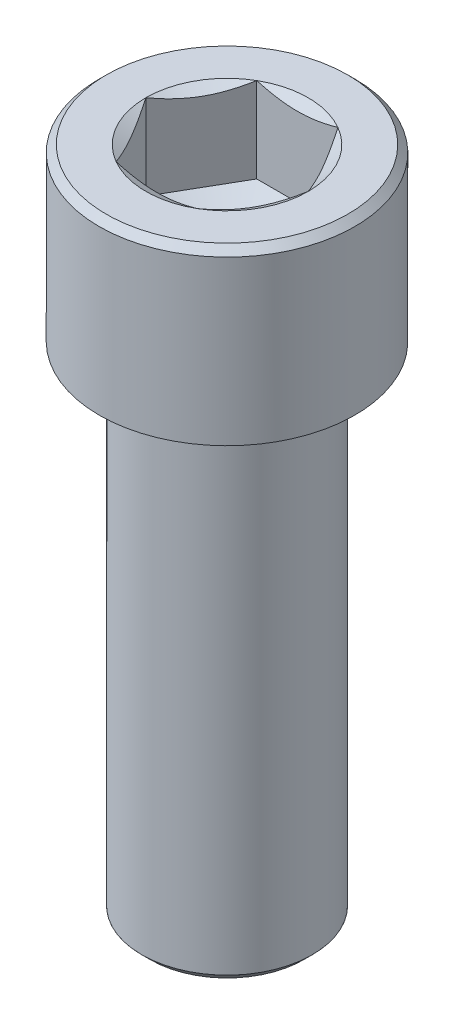
ISO-10303-21;
HEADER;
FILE_DESCRIPTION(('STEP AP214'),'2;1');
FILE_NAME('part.step','',(''),(''),'','','');
FILE_SCHEMA(('AUTOMOTIVE_DESIGN { 1 0 10303 214 1 1 1 1 }'));
ENDSEC;
DATA;
#1=APPLICATION_CONTEXT('core data for automotive mechanical design processes');
#2=APPLICATION_PROTOCOL_DEFINITION('international standard','automotive_design',2000,#1);
#3=PRODUCT_CONTEXT('',#1,'mechanical');
#4=PRODUCT('Part','Part','',(#3));
#5=PRODUCT_RELATED_PRODUCT_CATEGORY('part','',(#4));
#6=PRODUCT_DEFINITION_FORMATION('','',#4);
#7=PRODUCT_DEFINITION_CONTEXT('part definition',#1,'design');
#8=PRODUCT_DEFINITION('design','',#6,#7);
#9=PRODUCT_DEFINITION_SHAPE('','',#8);
#10=(LENGTH_UNIT() NAMED_UNIT(*) SI_UNIT(.MILLI.,.METRE.));
#11=(NAMED_UNIT(*) PLANE_ANGLE_UNIT() SI_UNIT($,.RADIAN.));
#12=(NAMED_UNIT(*) SI_UNIT($,.STERADIAN.) SOLID_ANGLE_UNIT());
#13=UNCERTAINTY_MEASURE_WITH_UNIT(LENGTH_MEASURE(1.E-05),#10,'distance_accuracy_value','');
#14=(GEOMETRIC_REPRESENTATION_CONTEXT(3) GLOBAL_UNCERTAINTY_ASSIGNED_CONTEXT((#13)) GLOBAL_UNIT_ASSIGNED_CONTEXT((#10,
#11,#12)) REPRESENTATION_CONTEXT('',''));
#15=CARTESIAN_POINT('',(0.,0.,0.));
#16=DIRECTION('',(0.,0.,1.));
#17=DIRECTION('',(1.,0.,0.));
#18=AXIS2_PLACEMENT_3D('',#15,#16,#17);
#19=CARTESIAN_POINT('',(0.,-6.00000000002865,0.));
#20=DIRECTION('',(0.,1.,0.));
#21=DIRECTION('',(0.,0.,1.));
#22=AXIS2_PLACEMENT_3D('',#19,#20,#21);
#23=CONICAL_SURFACE('',#22,5.71499999983871,1.04719755114345);
#24=CARTESIAN_POINT('',(2.55795384873636E-10,-9.2995567884202,0.));
#25=VERTEX_POINT('',#24);
#26=VERTEX_LOOP('',#25);
#27=FACE_BOUND('',#26,.T.);
#28=CARTESIAN_POINT('',(0.,-5.99999999996301,0.));
#29=DIRECTION('',(0.,1.,0.));
#30=DIRECTION('',(0.,0.,1.));
#31=AXIS2_PLACEMENT_3D('',#28,#29,#30);
#32=CIRCLE('',#31,5.7149999999524);
#33=CARTESIAN_POINT('',(-2.85749999997536,-5.99999999996301,-4.94933518258732));
#34=VERTEX_POINT('',#33);
#35=CARTESIAN_POINT('',(-5.71500000003238,-5.99999999994604,2.17632131555849E-11));
#36=VERTEX_POINT('',#35);
#37=EDGE_CURVE('P0_E77',#34,#36,#32,.T.);
#38=ORIENTED_EDGE('',*,*,#37,.T.);
#39=CARTESIAN_POINT('',(0.,-5.99999999996301,0.));
#40=DIRECTION('',(0.,1.,0.));
#41=DIRECTION('',(0.,0.,1.));
#42=AXIS2_PLACEMENT_3D('',#39,#40,#41);
#43=CIRCLE('',#42,5.7149999999524);
#44=CARTESIAN_POINT('',(-2.85749999997344,-5.99999999996301,4.94933518258843));
#45=VERTEX_POINT('',#44);
#46=EDGE_CURVE('P0_E79',#36,#45,#43,.T.);
#47=ORIENTED_EDGE('',*,*,#46,.T.);
#48=CARTESIAN_POINT('',(0.,-5.99999999996301,0.));
#49=DIRECTION('',(0.,1.,0.));
#50=DIRECTION('',(0.,0.,1.));
#51=AXIS2_PLACEMENT_3D('',#48,#49,#50);
#52=CIRCLE('',#51,5.7149999999524);
#53=CARTESIAN_POINT('',(2.85749999997536,-5.99999999996301,4.94933518258732));
#54=VERTEX_POINT('',#53);
#55=EDGE_CURVE('P0_E70',#45,#54,#52,.T.);
#56=ORIENTED_EDGE('',*,*,#55,.T.);
#57=CARTESIAN_POINT('',(0.,-5.99999999996301,0.));
#58=DIRECTION('',(0.,1.,0.));
#59=DIRECTION('',(0.,0.,1.));
#60=AXIS2_PLACEMENT_3D('',#57,#58,#59);
#61=CIRCLE('',#60,5.7149999999524);
#62=CARTESIAN_POINT('',(5.7149999999524,-5.99999999996301,2.22044604925031E-12));
#63=VERTEX_POINT('',#62);
#64=EDGE_CURVE('P0_E20',#54,#63,#61,.T.);
#65=ORIENTED_EDGE('',*,*,#64,.T.);
#66=CARTESIAN_POINT('',(0.,-5.99999999996301,0.));
#67=DIRECTION('',(0.,1.,0.));
#68=DIRECTION('',(0.,0.,1.));
#69=AXIS2_PLACEMENT_3D('',#66,#67,#68);
#70=CIRCLE('',#69,5.7149999999524);
#71=CARTESIAN_POINT('',(2.85749999997344,-5.99999999996301,-4.94933518258843));
#72=VERTEX_POINT('',#71);
#73=EDGE_CURVE('P0_E126',#63,#72,#70,.T.);
#74=ORIENTED_EDGE('',*,*,#73,.T.);
#75=CARTESIAN_POINT('',(0.,-5.99999999996301,0.));
#76=DIRECTION('',(0.,1.,0.));
#77=DIRECTION('',(0.,0.,1.));
#78=AXIS2_PLACEMENT_3D('',#75,#76,#77);
#79=CIRCLE('',#78,5.7149999999524);
#80=EDGE_CURVE('P0_E81',#72,#34,#79,.T.);
#81=ORIENTED_EDGE('',*,*,#80,.T.);
#82=EDGE_LOOP('',(#38,#47,#56,#65,#74,#81));
#83=FACE_BOUND('',#82,.T.);
#84=ADVANCED_FACE('P0_F17',(#27,#83),#23,.F.);
#85=CARTESIAN_POINT('',(0.,-6.,0.));
#86=DIRECTION('',(0.,1.,0.));
#87=DIRECTION('',(0.,0.,1.));
#88=AXIS2_PLACEMENT_3D('',#85,#86,#87);
#89=PLANE('',#88);
#90=DIRECTION('',(0.50000000000019,0.,-0.866025403784329));
#91=VECTOR('',#90,1.);
#92=CARTESIAN_POINT('',(2.8575,-6.,4.94933518263));
#93=LINE('',#92,#91);
#94=EDGE_CURVE('P0_E123',#54,#63,#93,.T.);
#95=ORIENTED_EDGE('',*,*,#94,.T.);
#96=ORIENTED_EDGE('',*,*,#64,.F.);
#97=EDGE_LOOP('',(#95,#96));
#98=FACE_BOUND('',#97,.T.);
#99=ADVANCED_FACE('P0_F75',(#98),#89,.F.);
#100=CARTESIAN_POINT('',(0.,-6.,0.));
#101=DIRECTION('',(0.,1.,0.));
#102=DIRECTION('',(0.,0.,1.));
#103=AXIS2_PLACEMENT_3D('',#100,#101,#102);
#104=PLANE('',#103);
#105=DIRECTION('',(1.,0.,0.));
#106=VECTOR('',#105,1.);
#107=CARTESIAN_POINT('',(-2.8575,-6.,4.94933518263));
#108=LINE('',#107,#106);
#109=EDGE_CURVE('P0_E122',#45,#54,#108,.T.);
#110=ORIENTED_EDGE('',*,*,#109,.T.);
#111=ORIENTED_EDGE('',*,*,#55,.F.);
#112=EDGE_LOOP('',(#110,#111));
#113=FACE_BOUND('',#112,.T.);
#114=ADVANCED_FACE('P0_F305',(#113),#104,.F.);
#115=CARTESIAN_POINT('',(0.,-6.,0.));
#116=DIRECTION('',(0.,1.,0.));
#117=DIRECTION('',(0.,0.,1.));
#118=AXIS2_PLACEMENT_3D('',#115,#116,#117);
#119=PLANE('',#118);
#120=DIRECTION('',(0.50000000000019,0.,0.866025403784329));
#121=VECTOR('',#120,1.);
#122=CARTESIAN_POINT('',(-5.715,-6.,0.));
#123=LINE('',#122,#121);
#124=EDGE_CURVE('P0_E90',#36,#45,#123,.T.);
#125=ORIENTED_EDGE('',*,*,#124,.T.);
#126=ORIENTED_EDGE('',*,*,#46,.F.);
#127=EDGE_LOOP('',(#125,#126));
#128=FACE_BOUND('',#127,.T.);
#129=ADVANCED_FACE('P0_F88',(#128),#119,.F.);
#130=CARTESIAN_POINT('',(0.,-6.,0.));
#131=DIRECTION('',(0.,1.,0.));
#132=DIRECTION('',(0.,0.,1.));
#133=AXIS2_PLACEMENT_3D('',#130,#131,#132);
#134=PLANE('',#133);
#135=DIRECTION('',(-0.50000000000019,0.,0.866025403784329));
#136=VECTOR('',#135,1.);
#137=CARTESIAN_POINT('',(-2.8575,-6.,-4.94933518263));
#138=LINE('',#137,#136);
#139=EDGE_CURVE('P0_E94',#34,#36,#138,.T.);
#140=ORIENTED_EDGE('',*,*,#139,.T.);
#141=ORIENTED_EDGE('',*,*,#37,.F.);
#142=EDGE_LOOP('',(#140,#141));
#143=FACE_BOUND('',#142,.T.);
#144=ADVANCED_FACE('P0_F95',(#143),#134,.F.);
#145=CARTESIAN_POINT('',(0.,-6.,0.));
#146=DIRECTION('',(0.,1.,0.));
#147=DIRECTION('',(0.,0.,1.));
#148=AXIS2_PLACEMENT_3D('',#145,#146,#147);
#149=PLANE('',#148);
#150=DIRECTION('',(-1.,0.,0.));
#151=VECTOR('',#150,1.);
#152=CARTESIAN_POINT('',(2.8575,-6.,-4.94933518263));
#153=LINE('',#152,#151);
#154=EDGE_CURVE('P0_E113',#72,#34,#153,.T.);
#155=ORIENTED_EDGE('',*,*,#154,.T.);
#156=ORIENTED_EDGE('',*,*,#80,.F.);
#157=EDGE_LOOP('',(#155,#156));
#158=FACE_BOUND('',#157,.T.);
#159=ADVANCED_FACE('P0_F312',(#158),#149,.F.);
#160=CARTESIAN_POINT('',(0.,-6.,0.));
#161=DIRECTION('',(0.,1.,0.));
#162=DIRECTION('',(0.,0.,1.));
#163=AXIS2_PLACEMENT_3D('',#160,#161,#162);
#164=PLANE('',#163);
#165=DIRECTION('',(-0.50000000000019,0.,-0.866025403784329));
#166=VECTOR('',#165,1.);
#167=CARTESIAN_POINT('',(5.715,-6.,0.));
#168=LINE('',#167,#166);
#169=EDGE_CURVE('P0_E127',#63,#72,#168,.T.);
#170=ORIENTED_EDGE('',*,*,#169,.T.);
#171=ORIENTED_EDGE('',*,*,#73,.F.);
#172=EDGE_LOOP('',(#170,#171));
#173=FACE_BOUND('',#172,.T.);
#174=ADVANCED_FACE('P0_F309',(#173),#164,.F.);
#175=CARTESIAN_POINT('',(2.8575,0.,4.94933518263));
#176=DIRECTION('',(0.866025403784329,0.,0.50000000000019));
#177=DIRECTION('',(0.50000000000019,0.,-0.866025403784329));
#178=AXIS2_PLACEMENT_3D('',#175,#176,#177);
#179=PLANE('',#178);
#180=CARTESIAN_POINT('',(2.85749999998902,-3.4732657478819E-11,4.9493351826402));
#181=CARTESIAN_POINT('',(2.98307639182353,-0.0725143055920489,4.73183049175742));
#182=CARTESIAN_POINT('',(3.10972684578101,-0.138468581895246,4.51246547070383));
#183=CARTESIAN_POINT('',(3.36522065473592,-0.253590375792021,4.06993721257654));
#184=CARTESIAN_POINT('',(3.49406854796522,-0.302717173718031,3.84676611505467));
#185=CARTESIAN_POINT('',(3.75018720290173,-0.379174179283381,3.40315559193823));
#186=CARTESIAN_POINT('',(3.87741808609623,-0.407013699313749,3.18278523795378));
#187=CARTESIAN_POINT('',(4.06871178361849,-0.431974734826106,2.85145483467774));
#188=CARTESIAN_POINT('',(4.1325199648056,-0.437496755266469,2.74093582292315));
#189=CARTESIAN_POINT('',(4.26019523355319,-0.442847568918802,2.51979577058241));
#190=CARTESIAN_POINT('',(4.32406231923219,-0.442676538077021,2.40917473325508));
#191=CARTESIAN_POINT('',(4.49902537963181,-0.434373710824644,2.10612982319536));
#192=CARTESIAN_POINT('',(4.61006333414092,-0.420439104268131,1.91380644441716));
#193=CARTESIAN_POINT('',(4.83140232300864,-0.376258882988186,1.53043607000254));
#194=CARTESIAN_POINT('',(4.941702579798,-0.345998176758566,1.33939042115557));
#195=CARTESIAN_POINT('',(5.16348724031605,-0.270356743710245,0.955248120799073));
#196=CARTESIAN_POINT('',(5.27494366371754,-0.224655607684441,0.762199932637897));
#197=CARTESIAN_POINT('',(5.49619462407052,-0.120933197648963,0.37898202808331));
#198=CARTESIAN_POINT('',(5.60599199330555,-0.0629362788968676,0.188807406030943));
#199=CARTESIAN_POINT('',(5.71500000005924,-8.51389413560627E-12,-9.81714173099331E-11));
#200=B_SPLINE_CURVE_WITH_KNOTS('',3,(#180,#181,#182,#183,#184,#185,#186,#187,#188,#189,#190,
#191,#192,#193,#194,#195,#196,#197,#198,#199),.UNSPECIFIED.,.F.,.F.,(4,2,2,2,2,2,2,2,2,4),(0.,
0.784509249733911,1.57090368617669,2.33783729623239,2.72093397397675,3.1040188119611,
3.7708598008455,4.43831826242367,5.12057775425332,5.80149825871335),.UNSPECIFIED.);
#201=CARTESIAN_POINT('',(2.8575000000161,-2.08754514809946E-11,4.94933518265789));
#202=VERTEX_POINT('',#201);
#203=CARTESIAN_POINT('',(5.715,3.633545098251E-10,0.));
#204=VERTEX_POINT('',#203);
#205=EDGE_CURVE('P0_E229',#202,#204,#200,.T.);
#206=ORIENTED_EDGE('',*,*,#205,.T.);
#207=DIRECTION('',(0.,1.,0.));
#208=VECTOR('',#207,1.);
#209=CARTESIAN_POINT('',(5.715,0.,0.));
#210=LINE('',#209,#208);
#211=EDGE_CURVE('P0_E287',#204,#63,#210,.F.);
#212=ORIENTED_EDGE('',*,*,#211,.T.);
#213=ORIENTED_EDGE('',*,*,#94,.F.);
#214=DIRECTION('',(0.,1.,0.));
#215=VECTOR('',#214,1.);
#216=CARTESIAN_POINT('',(2.8575,0.,4.94933518263));
#217=LINE('',#216,#215);
#218=EDGE_CURVE('P0_E107',#54,#202,#217,.T.);
#219=ORIENTED_EDGE('',*,*,#218,.T.);
#220=EDGE_LOOP('',(#206,#212,#213,#219));
#221=FACE_BOUND('',#220,.T.);
#222=ADVANCED_FACE('P0_F219',(#221),#179,.F.);
#223=CARTESIAN_POINT('',(-2.8575,0.,4.94933518263));
#224=DIRECTION('',(0.,0.,1.));
#225=DIRECTION('',(1.,0.,0.));
#226=AXIS2_PLACEMENT_3D('',#223,#224,#225);
#227=PLANE('',#226);
#228=CARTESIAN_POINT('',(-2.85750000001301,-3.1689146869664E-11,4.94933518262734));
#229=CARTESIAN_POINT('',(-2.60634721635044,-0.0725143055829996,4.94933518262905));
#230=CARTESIAN_POINT('',(-2.35304630843945,-0.138468581881023,4.94933518262974));
#231=CARTESIAN_POINT('',(-1.84205869053571,-0.253590375769099,4.94933518263026));
#232=CARTESIAN_POINT('',(-1.58436290407925,-0.302717173691593,4.94933518263007));
#233=CARTESIAN_POINT('',(-1.07212559421066,-0.379174179251841,4.94933518262994));
#234=CARTESIAN_POINT('',(-0.817663827823901,-0.407013699280505,4.94933518262999));
#235=CARTESIAN_POINT('',(-0.435076432782678,-0.431974734791741,4.94933518263001));
#236=CARTESIAN_POINT('',(-0.307460070409527,-0.43749675523197,4.94933518263));
#237=CARTESIAN_POINT('',(-0.0521095329165147,-0.442847568884505,4.94933518263));
#238=CARTESIAN_POINT('',(0.0756246384404027,-0.442676538043062,4.94933518263));
#239=CARTESIAN_POINT('',(0.425550759231622,-0.434373710792374,4.94933518263));
#240=CARTESIAN_POINT('',(0.647626668242956,-0.420439104238084,4.94933518263));
#241=CARTESIAN_POINT('',(1.09030464596498,-0.376258882964544,4.94933518263));
#242=CARTESIAN_POINT('',(1.31090515953716,-0.345998176739111,4.94933518263));
#243=CARTESIAN_POINT('',(1.75447448055972,-0.270356743700931,4.94933518263));
#244=CARTESIAN_POINT('',(1.9773873273557,-0.224655607681171,4.94933518263));
#245=CARTESIAN_POINT('',(2.41988924804838,-0.120933197658959,4.94933518263));
#246=CARTESIAN_POINT('',(2.63948398651212,-0.0629362789140752,4.94933518263));
#247=CARTESIAN_POINT('',(2.85750000001348,-3.32950938808065E-11,4.94933518263));
#248=B_SPLINE_CURVE_WITH_KNOTS('',3,(#228,#229,#230,#231,#232,#233,#234,#235,#236,#237,#238,
#239,#240,#241,#242,#243,#244,#245,#246,#247),.UNSPECIFIED.,.F.,.F.,(4,2,2,2,2,2,2,2,2,4),(0.,
0.784509249724737,1.57090368615804,2.33783729620738,2.72093397394863,3.10401881192987,
3.77085980079366,4.43831826235105,5.12057775415683,5.80149825859337),.UNSPECIFIED.);
#249=CARTESIAN_POINT('',(-2.85749999999808,-2.14306320819427E-11,4.94933518262889));
#250=VERTEX_POINT('',#249);
#251=EDGE_CURVE('P0_E223',#250,#202,#248,.T.);
#252=ORIENTED_EDGE('',*,*,#251,.T.);
#253=ORIENTED_EDGE('',*,*,#218,.F.);
#254=ORIENTED_EDGE('',*,*,#109,.F.);
#255=DIRECTION('',(0.,1.,0.));
#256=VECTOR('',#255,1.);
#257=CARTESIAN_POINT('',(-2.85749999999808,0.,4.94933518262889));
#258=LINE('',#257,#256);
#259=EDGE_CURVE('P0_E100',#45,#250,#258,.T.);
#260=ORIENTED_EDGE('',*,*,#259,.T.);
#261=EDGE_LOOP('',(#252,#253,#254,#260));
#262=FACE_BOUND('',#261,.T.);
#263=ADVANCED_FACE('P0_F215',(#262),#227,.F.);
#264=CARTESIAN_POINT('',(-5.715,0.,0.));
#265=DIRECTION('',(-0.866025403784329,0.,0.50000000000019));
#266=DIRECTION('',(0.50000000000019,0.,0.866025403784329));
#267=AXIS2_PLACEMENT_3D('',#264,#265,#266);
#268=PLANE('',#267);
#269=CARTESIAN_POINT('',(-5.71500000000335,-3.49581028037497E-11,-1.58955996922458E-11));
#270=CARTESIAN_POINT('',(-5.58942360817416,-0.0725143055925629,0.217504690869808));
#271=CARTESIAN_POINT('',(-5.46277315421888,-0.138468581895909,0.436869711924555));
#272=CARTESIAN_POINT('',(-5.2072793452656,-0.253590375792863,0.879397970052636));
#273=CARTESIAN_POINT('',(-5.07843145203575,-0.302717173718902,1.10256906757412));
#274=CARTESIAN_POINT('',(-4.82231279709887,-0.379174179284368,1.54617959069027));
#275=CARTESIAN_POINT('',(-4.69508191390453,-0.407013699314816,1.76654994467481));
#276=CARTESIAN_POINT('',(-4.50378821638233,-0.431974734827279,2.09788034795089));
#277=CARTESIAN_POINT('',(-4.4399800351952,-0.437496755267675,2.20839935970548));
#278=CARTESIAN_POINT('',(-4.31230476644759,-0.442847568920071,2.42953941204622));
#279=CARTESIAN_POINT('',(-4.24843768076859,-0.442676538078321,2.54016044937356));
#280=CARTESIAN_POINT('',(-4.07347462037312,-0.434373710826223,2.8432053594261));
#281=CARTESIAN_POINT('',(-3.96243666586816,-0.420439104270604,3.03552873819712));
#282=CARTESIAN_POINT('',(-3.74109767700866,-0.376258882993604,3.4188991125975));
#283=CARTESIAN_POINT('',(-3.63079742022338,-0.345998176766038,3.6099447614374));
#284=CARTESIAN_POINT('',(-3.40901275971356,-0.270356743722811,3.99408706177963));
#285=CARTESIAN_POINT('',(-3.29755633631624,-0.22465560770008,4.18713524993359));
#286=CARTESIAN_POINT('',(-3.07630537597143,-0.120933197671404,4.57035315447402));
#287=CARTESIAN_POINT('',(-2.96650800674042,-0.0629362789230307,4.76052777651944));
#288=CARTESIAN_POINT('',(-2.85749999999068,-3.85889477518737E-11,4.94933518264171));
#289=B_SPLINE_CURVE_WITH_KNOTS('',3,(#269,#270,#271,#272,#273,#274,#275,#276,#277,#278,#279,
#280,#281,#282,#283,#284,#285,#286,#287,#288),.UNSPECIFIED.,.F.,.F.,(4,2,2,2,2,2,2,2,2,4),(0.,
0.784509249733773,1.5709036861764,2.33783729623212,2.7209339739765,3.10401881196087,
3.77085980082036,4.43831826237351,5.12057775417687,5.80149825861082),.UNSPECIFIED.);
#290=CARTESIAN_POINT('',(-5.715000000034,-1.672274077873E-11,-5.56070107415863E-13));
#291=VERTEX_POINT('',#290);
#292=EDGE_CURVE('P0_E202',#291,#250,#289,.T.);
#293=ORIENTED_EDGE('',*,*,#292,.T.);
#294=ORIENTED_EDGE('',*,*,#259,.F.);
#295=ORIENTED_EDGE('',*,*,#124,.F.);
#296=DIRECTION('',(0.,1.,0.));
#297=VECTOR('',#296,1.);
#298=CARTESIAN_POINT('',(-5.71500000000192,0.,-1.11109038636314E-12));
#299=LINE('',#298,#297);
#300=EDGE_CURVE('P0_E99',#36,#291,#299,.T.);
#301=ORIENTED_EDGE('',*,*,#300,.T.);
#302=EDGE_LOOP('',(#293,#294,#295,#301));
#303=FACE_BOUND('',#302,.T.);
#304=ADVANCED_FACE('P0_F105',(#303),#268,.F.);
#305=CARTESIAN_POINT('',(-2.8575,0.,-4.94933518263));
#306=DIRECTION('',(-0.866025403784329,0.,-0.50000000000019));
#307=DIRECTION('',(-0.50000000000019,0.,0.866025403784329));
#308=AXIS2_PLACEMENT_3D('',#305,#306,#307);
#309=PLANE('',#308);
#310=CARTESIAN_POINT('',(-2.85749999212346,4.51849686138176E-09,-4.94933519627256));
#311=CARTESIAN_POINT('',(-2.9830763840851,-0.0725143014033868,-4.73183050516393));
#312=CARTESIAN_POINT('',(-3.10972683817167,-0.138468578096039,-4.51246548388444));
#313=CARTESIAN_POINT('',(-3.36522064739834,-0.253590372804506,-4.06993722528476));
#314=CARTESIAN_POINT('',(-3.49406854077038,-0.30271717115229,-3.84676612751628));
#315=CARTESIAN_POINT('',(-3.75018719599214,-0.379174177556078,-3.40315560390621));
#316=CARTESIAN_POINT('',(-3.87741807932864,-0.407013698004662,-3.18278524967562));
#317=CARTESIAN_POINT('',(-4.0687117770768,-0.431974734124017,-2.85145484600825));
#318=CARTESIAN_POINT('',(-4.13251995834096,-0.437496754763251,-2.74093583412022));
#319=CARTESIAN_POINT('',(-4.26019522724697,-0.442847568801574,-2.5197957815051));
#320=CARTESIAN_POINT('',(-4.32406231300736,-0.442676538146912,-2.40917474403681));
#321=CARTESIAN_POINT('',(-4.4990253739873,-0.434373711367414,-2.10612983297193));
#322=CARTESIAN_POINT('',(-4.61006332899896,-0.420439105024601,-1.91380645332328));
#323=CARTESIAN_POINT('',(-4.83140231887351,-0.376258884004695,-1.53043607716479));
#324=CARTESIAN_POINT('',(-4.94170257616712,-0.345998177821048,-1.33939042744443));
#325=CARTESIAN_POINT('',(-5.16348723771152,-0.27035674471043,-0.955248125310256));
#326=CARTESIAN_POINT('',(-5.27494366163472,-0.224655608570989,-0.762199936245444));
#327=CARTESIAN_POINT('',(-5.4961946230153,-0.120933198184581,-0.378982029911005));
#328=CARTESIAN_POINT('',(-5.60599199275626,-0.0629362791956838,-0.188807406982331));
#329=CARTESIAN_POINT('',(-5.715000000008,-2.53718525974386E-11,9.41850266157531E-12));
#330=B_SPLINE_CURVE_WITH_KNOTS('',3,(#310,#311,#312,#313,#314,#315,#316,#317,#318,#319,#320,
#321,#322,#323,#324,#325,#326,#327,#328,#329),.UNSPECIFIED.,.F.,.F.,(4,2,2,2,2,2,2,2,2,4),(0.,
0.784509250785821,1.57090368830772,2.33783729934748,2.72093397757907,3.10401881605069,
3.77085980789367,4.43831827244175,5.12057776740024,5.80149827496934),.UNSPECIFIED.);
#331=CARTESIAN_POINT('',(-2.85749999105864,3.83391509750621E-10,-4.94933518861713));
#332=VERTEX_POINT('',#331);
#333=EDGE_CURVE('P0_E111',#332,#291,#330,.T.);
#334=ORIENTED_EDGE('',*,*,#333,.T.);
#335=ORIENTED_EDGE('',*,*,#300,.F.);
#336=ORIENTED_EDGE('',*,*,#139,.F.);
#337=DIRECTION('',(0.,1.,0.));
#338=VECTOR('',#337,1.);
#339=CARTESIAN_POINT('',(-2.8575,0.,-4.94933518263));
#340=LINE('',#339,#338);
#341=EDGE_CURVE('P0_E115',#34,#332,#340,.T.);
#342=ORIENTED_EDGE('',*,*,#341,.T.);
#343=EDGE_LOOP('',(#334,#335,#336,#342));
#344=FACE_BOUND('',#343,.T.);
#345=ADVANCED_FACE('P0_F109',(#344),#309,.F.);
#346=CARTESIAN_POINT('',(2.8575,0.,-4.94933518263));
#347=DIRECTION('',(0.,0.,-1.));
#348=DIRECTION('',(-1.,0.,0.));
#349=AXIS2_PLACEMENT_3D('',#346,#347,#348);
#350=PLANE('',#349);
#351=CARTESIAN_POINT('',(2.85749998533007,-4.26386767876132E-09,-4.94933518263));
#352=CARTESIAN_POINT('',(2.60634720191525,-0.0725143094657814,-4.94933518263));
#353=CARTESIAN_POINT('',(2.35304629425376,-0.138468585393452,-4.94933518263));
#354=CARTESIAN_POINT('',(1.8420586768737,-0.253590378513508,-4.94933518263));
#355=CARTESIAN_POINT('',(1.58436289069157,-0.302717176038818,-4.94933518263));
#356=CARTESIAN_POINT('',(1.07212558136064,-0.379174180813702,-4.94933518263));
#357=CARTESIAN_POINT('',(0.817663815236114,-0.407013700451781,-4.94933518263));
#358=CARTESIAN_POINT('',(0.435076420611926,-0.431974735397021,-4.94933518263));
#359=CARTESIAN_POINT('',(0.307460058380827,-0.437496755651963,-4.94933518263));
#360=CARTESIAN_POINT('',(0.052109521180044,-0.442847568945018,-4.94933518263));
#361=CARTESIAN_POINT('',(-0.0756246500266964,-0.442676537929386,-4.94933518263));
#362=CARTESIAN_POINT('',(-0.425550768478799,-0.434373710269209,-4.94933518263));
#363=CARTESIAN_POINT('',(-0.647626675296158,-0.420439103645625,-4.94933518263));
#364=CARTESIAN_POINT('',(-1.09030464864844,-0.376258882567442,-4.94933518263));
#365=CARTESIAN_POINT('',(-1.31090516004493,-0.345998176607424,-4.94933518263));
#366=CARTESIAN_POINT('',(-1.75447447665384,-0.270356744395746,-4.94933518263));
#367=CARTESIAN_POINT('',(-1.97738732121378,-0.22465560894766,-4.94933518263));
#368=CARTESIAN_POINT('',(-2.41988923751029,-0.120933200285267,-4.94933518263));
#369=CARTESIAN_POINT('',(-2.63948397381363,-0.0629362823274531,-4.94933518263));
#370=CARTESIAN_POINT('',(-2.8574999851866,-4.30528624877756E-09,-4.94933518263));
#371=B_SPLINE_CURVE_WITH_KNOTS('',3,(#351,#352,#353,#354,#355,#356,#357,#358,#359,#360,#361,
#362,#363,#364,#365,#366,#367,#368,#369,#370),.UNSPECIFIED.,.F.,.F.,(4,2,2,2,2,2,2,2,2,4),(0.,
0.784509248718596,1.57090368411825,2.33783729325801,2.72093397054988,3.10401880808135,
3.77085979041132,4.43831824541028,5.1205777303106,5.80149822789066),.UNSPECIFIED.);
#372=CARTESIAN_POINT('',(2.85749999106421,3.63282801849827E-10,-4.94933518862788));
#373=VERTEX_POINT('',#372);
#374=EDGE_CURVE('P0_E167',#373,#332,#371,.T.);
#375=ORIENTED_EDGE('',*,*,#374,.T.);
#376=ORIENTED_EDGE('',*,*,#341,.F.);
#377=ORIENTED_EDGE('',*,*,#154,.F.);
#378=DIRECTION('',(0.,1.,0.));
#379=VECTOR('',#378,1.);
#380=CARTESIAN_POINT('',(2.85749999999808,0.,-4.94933518262889));
#381=LINE('',#380,#379);
#382=EDGE_CURVE('P0_E35',#72,#373,#381,.T.);
#383=ORIENTED_EDGE('',*,*,#382,.T.);
#384=EDGE_LOOP('',(#375,#376,#377,#383));
#385=FACE_BOUND('',#384,.T.);
#386=ADVANCED_FACE('P0_F210',(#385),#350,.F.);
#387=CARTESIAN_POINT('',(5.715,0.,0.));
#388=DIRECTION('',(0.866025403784329,0.,-0.50000000000019));
#389=DIRECTION('',(-0.50000000000019,0.,-0.866025403784329));
#390=AXIS2_PLACEMENT_3D('',#387,#388,#389);
#391=PLANE('',#390);
#392=CARTESIAN_POINT('',(5.71500000010735,-5.89151848442361E-11,7.54198173239809E-11));
#393=CARTESIAN_POINT('',(5.58942360824042,-0.0725143055919713,-0.217504690798276));
#394=CARTESIAN_POINT('',(5.46277315426906,-0.138468581885026,-0.4368697118492));
#395=CARTESIAN_POINT('',(5.2072793453022,-0.25359037577469,-0.879397969977655));
#396=CARTESIAN_POINT('',(5.07843145207486,-0.302717173703693,-1.10256906750337));
#397=CARTESIAN_POINT('',(4.82231279714306,-0.379174179270865,-1.54617959061666));
#398=CARTESIAN_POINT('',(4.69508191395147,-0.407013699300941,-1.76654994459405));
#399=CARTESIAN_POINT('',(4.50378821643485,-0.431974734815582,-2.09788034785964));
#400=CARTESIAN_POINT('',(4.43998003524993,-0.437496755257163,-2.20839935961062));
#401=CARTESIAN_POINT('',(4.31230476650658,-0.442847568912611,-2.42953941194413));
#402=CARTESIAN_POINT('',(4.24843768082962,-0.442676538072722,-2.54016044926787));
#403=CARTESIAN_POINT('',(4.07347461973988,-0.434373710792922,-2.84320536052286));
#404=CARTESIAN_POINT('',(3.96243666453949,-0.420439104098972,-3.03552874049843));
#405=CARTESIAN_POINT('',(3.74109767430061,-0.376258882349968,-3.41889911728799));
#406=CARTESIAN_POINT('',(3.63079741683141,-0.345998175788261,-3.60994476731248));
#407=CARTESIAN_POINT('',(3.40901275493814,-0.270356741910169,-3.9940870700509));
#408=CARTESIAN_POINT('',(3.29755633084196,-0.224655605380663,-4.18713525941533));
#409=CARTESIAN_POINT('',(3.07630536912474,-0.120933194227288,-4.57035316633284));
#410=CARTESIAN_POINT('',(2.96650799922009,-0.062936274861671,-4.76052778954504));
#411=CARTESIAN_POINT('',(2.85749999180611,4.6724036925877E-09,-4.94933519681779));
#412=B_SPLINE_CURVE_WITH_KNOTS('',3,(#392,#393,#394,#395,#396,#397,#398,#399,#400,#401,#402,
#403,#404,#405,#406,#407,#408,#409,#410,#411),.UNSPECIFIED.,.F.,.F.,(4,2,2,2,2,2,2,2,2,4),(0.,
0.784509249739847,1.57090368619177,2.33783729622474,2.72093397395659,3.10401881192873,
3.77085980496534,4.4383182707113,5.12057776692259,5.80149827573068),.UNSPECIFIED.);
#413=EDGE_CURVE('P0_E160',#204,#373,#412,.T.);
#414=ORIENTED_EDGE('',*,*,#413,.T.);
#415=ORIENTED_EDGE('',*,*,#382,.F.);
#416=ORIENTED_EDGE('',*,*,#169,.F.);
#417=ORIENTED_EDGE('',*,*,#211,.F.);
#418=EDGE_LOOP('',(#414,#415,#416,#417));
#419=FACE_BOUND('',#418,.T.);
#420=ADVANCED_FACE('P0_F174',(#419),#391,.F.);
#421=CARTESIAN_POINT('',(0.,-1.13686837721616E-10,0.));
#422=DIRECTION('',(0.,1.,0.));
#423=DIRECTION('',(0.,0.,1.));
#424=AXIS2_PLACEMENT_3D('',#421,#422,#423);
#425=CONICAL_SURFACE('',#424,5.71499999987708,1.04719755118202);
#426=ORIENTED_EDGE('',*,*,#205,.F.);
#427=CARTESIAN_POINT('',(0.,-4.04339778847259E-11,0.));
#428=DIRECTION('',(0.,1.,0.));
#429=DIRECTION('',(0.,0.,1.));
#430=AXIS2_PLACEMENT_3D('',#427,#428,#429);
#431=CIRCLE('',#430,5.71500000000395);
#432=EDGE_CURVE('P0_E157',#204,#202,#431,.F.);
#433=ORIENTED_EDGE('',*,*,#432,.F.);
#434=EDGE_LOOP('',(#426,#433));
#435=FACE_BOUND('',#434,.T.);
#436=ADVANCED_FACE('P0_F237',(#435),#425,.F.);
#437=CARTESIAN_POINT('',(0.,0.,0.));
#438=DIRECTION('',(0.,1.,0.));
#439=DIRECTION('',(0.,0.,1.));
#440=AXIS2_PLACEMENT_3D('',#437,#438,#439);
#441=CONICAL_SURFACE('',#440,5.71500000006608,1.04719755121076);
#442=ORIENTED_EDGE('',*,*,#251,.F.);
#443=CARTESIAN_POINT('',(0.,0.,0.));
#444=DIRECTION('',(0.,1.,0.));
#445=DIRECTION('',(0.,0.,1.));
#446=AXIS2_PLACEMENT_3D('',#443,#444,#445);
#447=CIRCLE('',#446,5.71500000006608);
#448=EDGE_CURVE('P0_E154',#202,#250,#447,.F.);
#449=ORIENTED_EDGE('',*,*,#448,.F.);
#450=EDGE_LOOP('',(#442,#449));
#451=FACE_BOUND('',#450,.T.);
#452=ADVANCED_FACE('P0_F234',(#451),#441,.F.);
#453=CARTESIAN_POINT('',(0.,-1.13686837721616E-10,0.));
#454=DIRECTION('',(0.,1.,0.));
#455=DIRECTION('',(0.,0.,1.));
#456=AXIS2_PLACEMENT_3D('',#453,#454,#455);
#457=CONICAL_SURFACE('',#456,5.71499999987708,1.04719755118202);
#458=ORIENTED_EDGE('',*,*,#292,.F.);
#459=CARTESIAN_POINT('',(0.,-4.04344786562588E-11,0.));
#460=DIRECTION('',(0.,1.,0.));
#461=DIRECTION('',(0.,0.,1.));
#462=AXIS2_PLACEMENT_3D('',#459,#460,#461);
#463=CIRCLE('',#462,5.71500000000395);
#464=EDGE_CURVE('P0_E151',#250,#291,#463,.F.);
#465=ORIENTED_EDGE('',*,*,#464,.F.);
#466=EDGE_LOOP('',(#458,#465));
#467=FACE_BOUND('',#466,.T.);
#468=ADVANCED_FACE('P0_F193',(#467),#457,.F.);
#469=CARTESIAN_POINT('',(0.,7.95807864051312E-10,0.));
#470=DIRECTION('',(0.,1.,0.));
#471=DIRECTION('',(0.,0.,1.));
#472=AXIS2_PLACEMENT_3D('',#469,#470,#471);
#473=CONICAL_SURFACE('',#472,5.71500000143033,1.04719755121137);
#474=ORIENTED_EDGE('',*,*,#333,.F.);
#475=CARTESIAN_POINT('',(0.,8.16234773548107E-12,0.));
#476=DIRECTION('',(0.,1.,0.));
#477=DIRECTION('',(0.,0.,1.));
#478=AXIS2_PLACEMENT_3D('',#475,#476,#477);
#479=CIRCLE('',#478,5.71500000006608);
#480=EDGE_CURVE('P0_E148',#291,#332,#479,.F.);
#481=ORIENTED_EDGE('',*,*,#480,.F.);
#482=EDGE_LOOP('',(#474,#481));
#483=FACE_BOUND('',#482,.T.);
#484=ADVANCED_FACE('P0_F188',(#483),#473,.F.);
#485=CARTESIAN_POINT('',(0.,7.95807864051312E-10,0.));
#486=DIRECTION('',(0.,1.,0.));
#487=DIRECTION('',(0.,0.,1.));
#488=AXIS2_PLACEMENT_3D('',#485,#486,#487);
#489=CONICAL_SURFACE('',#488,5.71500000143033,1.04719755121137);
#490=ORIENTED_EDGE('',*,*,#374,.F.);
#491=CARTESIAN_POINT('',(0.,7.95807864051312E-10,0.));
#492=DIRECTION('',(0.,1.,0.));
#493=DIRECTION('',(0.,0.,1.));
#494=AXIS2_PLACEMENT_3D('',#491,#492,#493);
#495=CIRCLE('',#494,5.71500000143033);
#496=EDGE_CURVE('P0_E145',#332,#373,#495,.F.);
#497=ORIENTED_EDGE('',*,*,#496,.F.);
#498=EDGE_LOOP('',(#490,#497));
#499=FACE_BOUND('',#498,.T.);
#500=ADVANCED_FACE('P0_F182',(#499),#489,.F.);
#501=CARTESIAN_POINT('',(0.,7.38964445190504E-10,0.));
#502=DIRECTION('',(0.,1.,0.));
#503=DIRECTION('',(0.,0.,1.));
#504=AXIS2_PLACEMENT_3D('',#501,#502,#503);
#505=CONICAL_SURFACE('',#504,5.7150000013788,1.04719755120265);
#506=ORIENTED_EDGE('',*,*,#413,.F.);
#507=CARTESIAN_POINT('',(0.,7.83795515902326E-10,0.));
#508=DIRECTION('',(0.,1.,0.));
#509=DIRECTION('',(0.,0.,1.));
#510=AXIS2_PLACEMENT_3D('',#507,#508,#509);
#511=CIRCLE('',#510,5.71500000145645);
#512=EDGE_CURVE('P0_E142',#373,#204,#511,.F.);
#513=ORIENTED_EDGE('',*,*,#512,.F.);
#514=EDGE_LOOP('',(#506,#513));
#515=FACE_BOUND('',#514,.T.);
#516=ADVANCED_FACE('P0_F177',(#515),#505,.F.);
#517=CARTESIAN_POINT('',(0.,0.,0.));
#518=DIRECTION('',(0.,1.,0.));
#519=DIRECTION('',(0.,0.,1.));
#520=AXIS2_PLACEMENT_3D('',#517,#518,#519);
#521=PLANE('',#520);
#522=ORIENTED_EDGE('',*,*,#496,.T.);
#523=ORIENTED_EDGE('',*,*,#512,.T.);
#524=ORIENTED_EDGE('',*,*,#432,.T.);
#525=ORIENTED_EDGE('',*,*,#448,.T.);
#526=ORIENTED_EDGE('',*,*,#464,.T.);
#527=ORIENTED_EDGE('',*,*,#480,.T.);
#528=EDGE_LOOP('',(#522,#523,#524,#525,#526,#527));
#529=FACE_BOUND('',#528,.T.);
#530=CARTESIAN_POINT('',(0.,-1.17093834628434E-12,0.));
#531=DIRECTION('',(0.,-1.,0.));
#532=DIRECTION('',(0.,0.,-1.));
#533=AXIS2_PLACEMENT_3D('',#530,#531,#532);
#534=CIRCLE('',#533,8.49999999999883);
#535=CARTESIAN_POINT('',(0.,-1.17093834628434E-12,-8.49999999999883));
#536=VERTEX_POINT('',#535);
#537=EDGE_CURVE('P0_E139',#536,#536,#534,.T.);
#538=ORIENTED_EDGE('',*,*,#537,.F.);
#539=EDGE_LOOP('',(#538));
#540=FACE_BOUND('',#539,.T.);
#541=ADVANCED_FACE('P0_F181',(#529,#540),#521,.T.);
#542=CARTESIAN_POINT('',(0.,-0.500000000001395,0.));
#543=DIRECTION('',(0.,-1.,0.));
#544=DIRECTION('',(0.,0.,-1.));
#545=AXIS2_PLACEMENT_3D('',#542,#543,#544);
#546=CONICAL_SURFACE('',#545,8.99999999999861,0.785398163397);
#547=CARTESIAN_POINT('',(0.,-0.5,0.));
#548=DIRECTION('',(0.,1.,0.));
#549=DIRECTION('',(0.,0.,1.));
#550=AXIS2_PLACEMENT_3D('',#547,#548,#549);
#551=CIRCLE('',#550,9.);
#552=CARTESIAN_POINT('',(0.,-0.5,9.));
#553=VERTEX_POINT('',#552);
#554=EDGE_CURVE('P0_E138',#553,#553,#551,.F.);
#555=ORIENTED_EDGE('',*,*,#554,.F.);
#556=EDGE_LOOP('',(#555));
#557=FACE_BOUND('',#556,.T.);
#558=ORIENTED_EDGE('',*,*,#537,.T.);
#559=EDGE_LOOP('',(#558));
#560=FACE_BOUND('',#559,.T.);
#561=ADVANCED_FACE('P0_F270',(#557,#560),#546,.T.);
#562=CARTESIAN_POINT('',(0.,-47.,0.));
#563=DIRECTION('',(0.,1.,0.));
#564=DIRECTION('',(0.,0.,1.));
#565=AXIS2_PLACEMENT_3D('',#562,#563,#564);
#566=PLANE('',#565);
#567=CARTESIAN_POINT('',(0.,-46.9999999999118,0.));
#568=DIRECTION('',(0.,1.,0.));
#569=DIRECTION('',(0.,0.,1.));
#570=AXIS2_PLACEMENT_3D('',#567,#568,#569);
#571=CIRCLE('',#570,5.39999999995189);
#572=CARTESIAN_POINT('',(0.,-46.9999999999118,5.39999999995189));
#573=VERTEX_POINT('',#572);
#574=EDGE_CURVE('P0_E135',#573,#573,#571,.T.);
#575=ORIENTED_EDGE('',*,*,#574,.F.);
#576=EDGE_LOOP('',(#575));
#577=FACE_BOUND('',#576,.T.);
#578=ADVANCED_FACE('P0_F267',(#577),#566,.F.);
#579=CARTESIAN_POINT('',(0.,-49.35,0.));
#580=DIRECTION('',(0.,1.,0.));
#581=DIRECTION('',(0.,0.,1.));
#582=AXIS2_PLACEMENT_3D('',#579,#580,#581);
#583=CYLINDRICAL_SURFACE('',#582,9.);
#584=CARTESIAN_POINT('',(0.,-12.,0.));
#585=DIRECTION('',(0.,1.,0.));
#586=DIRECTION('',(0.,0.,1.));
#587=AXIS2_PLACEMENT_3D('',#584,#585,#586);
#588=CIRCLE('',#587,9.);
#589=CARTESIAN_POINT('',(0.,-12.,9.));
#590=VERTEX_POINT('',#589);
#591=EDGE_CURVE('P0_E132',#590,#590,#588,.T.);
#592=ORIENTED_EDGE('',*,*,#591,.T.);
#593=EDGE_LOOP('',(#592));
#594=FACE_BOUND('',#593,.T.);
#595=ORIENTED_EDGE('',*,*,#554,.T.);
#596=EDGE_LOOP('',(#595));
#597=FACE_BOUND('',#596,.T.);
#598=ADVANCED_FACE('P0_F263',(#594,#597),#583,.T.);
#599=CARTESIAN_POINT('',(0.,-46.3999999998919,0.));
#600=DIRECTION('',(0.,1.,0.));
#601=DIRECTION('',(0.,0.,1.));
#602=AXIS2_PLACEMENT_3D('',#599,#600,#601);
#603=CONICAL_SURFACE('',#602,5.99999999997181,0.785398163397448);
#604=CARTESIAN_POINT('',(0.,-46.4,0.));
#605=DIRECTION('',(0.,1.,0.));
#606=DIRECTION('',(0.,0.,1.));
#607=AXIS2_PLACEMENT_3D('',#604,#605,#606);
#608=CIRCLE('',#607,6.);
#609=CARTESIAN_POINT('',(0.,-46.4,6.));
#610=VERTEX_POINT('',#609);
#611=EDGE_CURVE('P0_E26',#610,#610,#608,.T.);
#612=ORIENTED_EDGE('',*,*,#611,.F.);
#613=EDGE_LOOP('',(#612));
#614=FACE_BOUND('',#613,.T.);
#615=ORIENTED_EDGE('',*,*,#574,.T.);
#616=EDGE_LOOP('',(#615));
#617=FACE_BOUND('',#616,.T.);
#618=ADVANCED_FACE('P0_F256',(#614,#617),#603,.T.);
#619=CARTESIAN_POINT('',(0.,-12.,0.));
#620=DIRECTION('',(0.,1.,0.));
#621=DIRECTION('',(0.,0.,1.));
#622=AXIS2_PLACEMENT_3D('',#619,#620,#621);
#623=PLANE('',#622);
#624=CARTESIAN_POINT('',(0.,-12.,0.));
#625=DIRECTION('',(0.,1.,0.));
#626=DIRECTION('',(0.,0.,1.));
#627=AXIS2_PLACEMENT_3D('',#624,#625,#626);
#628=CIRCLE('',#627,6.);
#629=CARTESIAN_POINT('',(0.,-12.,6.));
#630=VERTEX_POINT('',#629);
#631=EDGE_CURVE('P0_E11',#630,#630,#628,.F.);
#632=ORIENTED_EDGE('',*,*,#631,.F.);
#633=EDGE_LOOP('',(#632));
#634=FACE_BOUND('',#633,.T.);
#635=ORIENTED_EDGE('',*,*,#591,.F.);
#636=EDGE_LOOP('',(#635));
#637=FACE_BOUND('',#636,.T.);
#638=ADVANCED_FACE('P0_F250',(#634,#637),#623,.F.);
#639=CARTESIAN_POINT('',(0.,-49.35,0.));
#640=DIRECTION('',(0.,1.,0.));
#641=DIRECTION('',(0.,0.,1.));
#642=AXIS2_PLACEMENT_3D('',#639,#640,#641);
#643=CYLINDRICAL_SURFACE('',#642,6.);
#644=ORIENTED_EDGE('',*,*,#631,.T.);
#645=EDGE_LOOP('',(#644));
#646=FACE_BOUND('',#645,.T.);
#647=ORIENTED_EDGE('',*,*,#611,.T.);
#648=EDGE_LOOP('',(#647));
#649=FACE_BOUND('',#648,.T.);
#650=ADVANCED_FACE('P0_F248',(#646,#649),#643,.T.);
#651=CLOSED_SHELL('',(#84,#99,#114,#129,#144,#159,#174,#222,#263,#304,#345,#386,#420,#436,#452,
#468,#484,#500,#516,#541,#561,#578,#598,#618,#638,#650));
#652=MANIFOLD_SOLID_BREP('P0_B1',#651);
#653=CARTESIAN_POINT('',(0.,-46.4,0.));
#654=DIRECTION('',(0.,1.,0.));
#655=DIRECTION('',(0.,0.,1.));
#656=AXIS2_PLACEMENT_3D('',#653,#654,#655);
#657=CYLINDRICAL_SURFACE('',#656,5.053);
#658=CARTESIAN_POINT('',(0.,-12.,0.));
#659=DIRECTION('',(0.,1.,0.));
#660=DIRECTION('',(0.,0.,1.));
#661=AXIS2_PLACEMENT_3D('',#658,#659,#660);
#662=CIRCLE('',#661,5.053);
#663=CARTESIAN_POINT('',(0.,-12.,5.053));
#664=VERTEX_POINT('',#663);
#665=EDGE_CURVE('P1_E21',#664,#664,#662,.F.);
#666=ORIENTED_EDGE('',*,*,#665,.T.);
#667=EDGE_LOOP('',(#666));
#668=FACE_BOUND('',#667,.T.);
#669=CARTESIAN_POINT('',(0.,-46.4,0.));
#670=DIRECTION('',(0.,1.,0.));
#671=DIRECTION('',(0.,0.,1.));
#672=AXIS2_PLACEMENT_3D('',#669,#670,#671);
#673=CIRCLE('',#672,5.053);
#674=CARTESIAN_POINT('',(0.,-46.4,5.053));
#675=VERTEX_POINT('',#674);
#676=EDGE_CURVE('P1_E11',#675,#675,#673,.T.);
#677=ORIENTED_EDGE('',*,*,#676,.T.);
#678=EDGE_LOOP('',(#677));
#679=FACE_BOUND('',#678,.T.);
#680=ADVANCED_FACE('P1_F17',(#668,#679),#657,.T.);
#681=CARTESIAN_POINT('',(4.40465532995,-46.4,-4.07418843751));
#682=DIRECTION('',(0.,1.,0.));
#683=DIRECTION('',(0.,0.,1.));
#684=AXIS2_PLACEMENT_3D('',#681,#682,#683);
#685=PLANE('',#684);
#686=ORIENTED_EDGE('',*,*,#676,.F.);
#687=EDGE_LOOP('',(#686));
#688=FACE_BOUND('',#687,.T.);
#689=CARTESIAN_POINT('',(6.,-46.4,0.));
#690=CARTESIAN_POINT('',(6.00065494812525,-46.4,-0.588091706671481));
#691=CARTESIAN_POINT('',(5.88469227518413,-46.4,-1.17053785005098));
#692=CARTESIAN_POINT('',(5.76923107386057,-46.4,-1.75046525009481));
#693=CARTESIAN_POINT('',(5.54328306235342,-46.4,-2.29610017107641));
#694=CARTESIAN_POINT('',(5.31736411026986,-46.4,-2.84166491734752));
#695=CARTESIAN_POINT('',(4.9888094385563,-46.4,-3.3334161945748));
#696=CARTESIAN_POINT('',(4.66063779752068,-46.4,-3.824594185706));
#697=CARTESIAN_POINT('',(4.24263510466776,-46.4,-4.24263281694451));
#698=CARTESIAN_POINT('',(3.82499844152852,-46.4,-4.6603053869994));
#699=CARTESIAN_POINT('',(3.33341437244664,-46.4,-4.98880580833633));
#700=CARTESIAN_POINT('',(2.84235632837936,-46.4,-5.31695471413441));
#701=CARTESIAN_POINT('',(2.29609515632737,-46.4,-5.54326201273784));
#702=CARTESIAN_POINT('',(1.75052718662661,-46.4,-5.76928212865372));
#703=CARTESIAN_POINT('',(1.17053881709131,-46.4,-5.88469413671276));
#704=CARTESIAN_POINT('',(0.591447119479773,-46.4,-5.99992771583644));
#705=CARTESIAN_POINT('',(1.00154259885521E-11,-46.4,-5.99998162275));
#706=CARTESIAN_POINT('',(-0.590353265130128,-46.4,-6.00003542996519));
#707=CARTESIAN_POINT('',(-1.17053881707052,-46.4,-5.88469413671699));
#708=CARTESIAN_POINT('',(-1.74947521769474,-46.4,-5.76960117562354));
#709=CARTESIAN_POINT('',(-2.29609515628904,-46.4,-5.54326201275336));
#710=CARTESIAN_POINT('',(-2.84138655860159,-46.4,-5.31747295749659));
#711=CARTESIAN_POINT('',(-3.33341437242715,-46.4,-4.9888058083498));
#712=CARTESIAN_POINT('',(-3.82414804811487,-46.4,-4.66100312393533));
#713=CARTESIAN_POINT('',(-4.24263510465105,-46.4,-4.2426328169607));
#714=CARTESIAN_POINT('',(-4.65993956670648,-46.4,-3.8254447745465));
#715=CARTESIAN_POINT('',(-4.98880943855652,-46.4,-3.33341619457505));
#716=CARTESIAN_POINT('',(-5.31684473399887,-46.4,-2.8426362405189));
#717=CARTESIAN_POINT('',(-5.54328306234765,-46.4,-2.29610017109032));
#718=CARTESIAN_POINT('',(-5.76891132709336,-46.4,-1.75151928734446));
#719=CARTESIAN_POINT('',(-5.88469227517541,-46.4,-1.17053785009393));
#720=CARTESIAN_POINT('',(-6.00065556037297,-46.4,-0.588641456788999));
#721=CARTESIAN_POINT('',(-6.,-46.4,0.));
#722=B_SPLINE_CURVE_WITH_KNOTS('',2,(#689,#690,#691,#692,#693,#694,#695,#696,#697,#698,#699,
#700,#701,#702,#703,#704,#705,#706,#707,#708,#709,#710,#711,#712,#713,#714,#715,#716,#717,#718,
#719,#720,#721),.UNSPECIFIED.,.F.,.F.,(3,2,2,2,2,2,2,2,2,2,2,2,2,2,2,2,3),(0.,0.0625,0.125,
0.1875,0.25,0.3125,0.375,0.4375,0.5,0.5625,0.625,0.6875,0.75,0.8125,0.875,0.9375,1.),.UNSPECIFIED.);
#723=CARTESIAN_POINT('',(6.,-46.4,0.));
#724=VERTEX_POINT('',#723);
#725=CARTESIAN_POINT('',(-6.,-46.4,0.));
#726=VERTEX_POINT('',#725);
#727=EDGE_CURVE('P1_E32',#724,#726,#722,.T.);
#728=ORIENTED_EDGE('',*,*,#727,.T.);
#729=CARTESIAN_POINT('',(-6.,-46.4,0.));
#730=CARTESIAN_POINT('',(-6.00065494812525,-46.4,0.588091706673826));
#731=CARTESIAN_POINT('',(-5.88469227518413,-46.4,1.17053785005098));
#732=CARTESIAN_POINT('',(-5.76923107385966,-46.4,1.75046525009699));
#733=CARTESIAN_POINT('',(-5.54328306235342,-46.4,2.29610017107641));
#734=CARTESIAN_POINT('',(-5.31736411027088,-46.4,2.84166491734506));
#735=CARTESIAN_POINT('',(-4.9888094385563,-46.4,3.3334161945748));
#736=CARTESIAN_POINT('',(-4.6606377975235,-46.4,3.82459418570271));
#737=CARTESIAN_POINT('',(-4.24263510466776,-46.4,4.24263281694451));
#738=CARTESIAN_POINT('',(-3.82499844152993,-46.4,4.66030538699846));
#739=CARTESIAN_POINT('',(-3.33341437244664,-46.4,4.98880580833633));
#740=CARTESIAN_POINT('',(-2.84235632837789,-46.4,5.31695471413539));
#741=CARTESIAN_POINT('',(-2.29609515632737,-46.4,5.54326201273784));
#742=CARTESIAN_POINT('',(-1.75052718662488,-46.4,5.76928212865406));
#743=CARTESIAN_POINT('',(-1.17053881709131,-46.4,5.88469413671276));
#744=CARTESIAN_POINT('',(-0.591447119482128,-46.4,5.99992771583598));
#745=CARTESIAN_POINT('',(-1.00154259885521E-11,-46.4,5.99998162275));
#746=CARTESIAN_POINT('',(0.590353265127309,-46.4,6.00003542996566));
#747=CARTESIAN_POINT('',(1.17053881707052,-46.4,5.88469413671699));
#748=CARTESIAN_POINT('',(1.74947521769385,-46.4,5.76960117562381));
#749=CARTESIAN_POINT('',(2.29609515628904,-46.4,5.54326201275336));
#750=CARTESIAN_POINT('',(2.84138655860182,-46.4,5.31747295749659));
#751=CARTESIAN_POINT('',(3.33341437242715,-46.4,4.9888058083498));
#752=CARTESIAN_POINT('',(3.82414804811675,-46.4,4.66100312393391));
#753=CARTESIAN_POINT('',(4.24263510465105,-46.4,4.2426328169607));
#754=CARTESIAN_POINT('',(4.65993956670601,-46.4,3.8254447745465));
#755=CARTESIAN_POINT('',(4.98880943855652,-46.4,3.33341619457505));
#756=CARTESIAN_POINT('',(5.3168447339959,-46.4,2.84263624052405));
#757=CARTESIAN_POINT('',(5.54328306234765,-46.4,2.29610017109032));
#758=CARTESIAN_POINT('',(5.76891132709349,-46.4,1.75151928734617));
#759=CARTESIAN_POINT('',(5.88469227517541,-46.4,1.17053785009393));
#760=CARTESIAN_POINT('',(6.00065556037297,-46.4,0.588641456786654));
#761=CARTESIAN_POINT('',(6.,-46.4,0.));
#762=B_SPLINE_CURVE_WITH_KNOTS('',2,(#729,#730,#731,#732,#733,#734,#735,#736,#737,#738,#739,
#740,#741,#742,#743,#744,#745,#746,#747,#748,#749,#750,#751,#752,#753,#754,#755,#756,#757,#758,
#759,#760,#761),.UNSPECIFIED.,.F.,.F.,(3,2,2,2,2,2,2,2,2,2,2,2,2,2,2,2,3),(0.,0.0625,0.125,
0.1875,0.25,0.3125,0.375,0.4375,0.5,0.5625,0.625,0.6875,0.75,0.8125,0.875,0.9375,1.),.UNSPECIFIED.);
#763=EDGE_CURVE('P1_E51',#726,#724,#762,.T.);
#764=ORIENTED_EDGE('',*,*,#763,.T.);
#765=EDGE_LOOP('',(#728,#764));
#766=FACE_BOUND('',#765,.T.);
#767=ADVANCED_FACE('P1_F69',(#688,#766),#685,.T.);
#768=CARTESIAN_POINT('',(0.,-12.,0.));
#769=DIRECTION('',(0.,1.,0.));
#770=DIRECTION('',(0.,0.,1.));
#771=AXIS2_PLACEMENT_3D('',#768,#769,#770);
#772=PLANE('',#771);
#773=ORIENTED_EDGE('',*,*,#665,.F.);
#774=EDGE_LOOP('',(#773));
#775=FACE_BOUND('',#774,.T.);
#776=CARTESIAN_POINT('',(-6.,-12.,0.));
#777=CARTESIAN_POINT('',(-6.00065494812528,-12.,0.588091706701703));
#778=CARTESIAN_POINT('',(-5.88469227517541,-12.,1.17053785009393));
#779=CARTESIAN_POINT('',(-5.76923107384716,-12.,1.75046525013022));
#780=CARTESIAN_POINT('',(-5.54328306234765,-12.,2.29610017109032));
#781=CARTESIAN_POINT('',(-5.31736411026566,-12.,2.8416649173546));
#782=CARTESIAN_POINT('',(-4.98880943855652,-12.,3.33341619457505));
#783=CARTESIAN_POINT('',(-4.66063779751211,-12.,3.8245941857192));
#784=CARTESIAN_POINT('',(-4.24263510465105,-12.,4.2426328169607));
#785=CARTESIAN_POINT('',(-3.82499844150203,-12.,4.66030538702023));
#786=CARTESIAN_POINT('',(-3.33341437242715,-12.,4.9888058083498));
#787=CARTESIAN_POINT('',(-2.84235632836024,-12.,5.31695471414496));
#788=CARTESIAN_POINT('',(-2.29609515628904,-12.,5.54326201275336));
#789=CARTESIAN_POINT('',(-1.75052718660035,-12.,5.76928212866127));
#790=CARTESIAN_POINT('',(-1.17053881707052,-12.,5.88469413671699));
#791=CARTESIAN_POINT('',(-0.59144711945731,-12.,5.99992771583879));
#792=CARTESIAN_POINT('',(1.00154259885521E-11,-12.,5.99998162275));
#793=CARTESIAN_POINT('',(0.590353265152241,-12.,6.00003542996285));
#794=CARTESIAN_POINT('',(1.17053881709131,-12.,5.88469413671276));
#795=CARTESIAN_POINT('',(1.7494752177272,-12.,5.76960117561483));
#796=CARTESIAN_POINT('',(2.29609515632737,-12.,5.54326201273784));
#797=CARTESIAN_POINT('',(2.84138655862439,-12.,5.31747295748311));
#798=CARTESIAN_POINT('',(3.33341437244664,-12.,4.98880580833633));
#799=CARTESIAN_POINT('',(3.82414804813572,-12.,4.66100312391874));
#800=CARTESIAN_POINT('',(4.24263510466776,-12.,4.24263281694451));
#801=CARTESIAN_POINT('',(4.65993956670751,-12.,3.82544477454225));
#802=CARTESIAN_POINT('',(4.9888094385563,-12.,3.3334161945748));
#803=CARTESIAN_POINT('',(5.31684473400104,-12.,2.8426362405172));
#804=CARTESIAN_POINT('',(5.54328306235342,-12.,2.29610017107641));
#805=CARTESIAN_POINT('',(5.76891132710601,-12.,1.75151928731043));
#806=CARTESIAN_POINT('',(5.88469227518413,-12.,1.17053785005098));
#807=CARTESIAN_POINT('',(6.00065556037294,-12.,0.588641456761265));
#808=CARTESIAN_POINT('',(6.,-12.,0.));
#809=B_SPLINE_CURVE_WITH_KNOTS('',2,(#776,#777,#778,#779,#780,#781,#782,#783,#784,#785,#786,
#787,#788,#789,#790,#791,#792,#793,#794,#795,#796,#797,#798,#799,#800,#801,#802,#803,#804,#805,
#806,#807,#808),.UNSPECIFIED.,.F.,.F.,(3,2,2,2,2,2,2,2,2,2,2,2,2,2,2,2,3),(0.,0.0625,0.125,
0.1875,0.25,0.3125,0.375,0.4375,0.5,0.5625,0.625,0.6875,0.75,0.8125,0.875,0.9375,1.),.UNSPECIFIED.);
#810=CARTESIAN_POINT('',(-6.,-12.,0.));
#811=VERTEX_POINT('',#810);
#812=CARTESIAN_POINT('',(6.,-12.,0.));
#813=VERTEX_POINT('',#812);
#814=EDGE_CURVE('P1_E40',#811,#813,#809,.T.);
#815=ORIENTED_EDGE('',*,*,#814,.F.);
#816=CARTESIAN_POINT('',(6.,-12.,0.));
#817=CARTESIAN_POINT('',(6.00065494812528,-12.,-0.588091706701703));
#818=CARTESIAN_POINT('',(5.88469227517541,-12.,-1.17053785009393));
#819=CARTESIAN_POINT('',(5.76923107384716,-12.,-1.75046525013022));
#820=CARTESIAN_POINT('',(5.54328306234765,-12.,-2.29610017109032));
#821=CARTESIAN_POINT('',(5.31736411026566,-12.,-2.8416649173546));
#822=CARTESIAN_POINT('',(4.98880943855652,-12.,-3.33341619457505));
#823=CARTESIAN_POINT('',(4.66063779751211,-12.,-3.8245941857192));
#824=CARTESIAN_POINT('',(4.24263510465105,-12.,-4.2426328169607));
#825=CARTESIAN_POINT('',(3.82499844150203,-12.,-4.66030538702023));
#826=CARTESIAN_POINT('',(3.33341437242715,-12.,-4.9888058083498));
#827=CARTESIAN_POINT('',(2.84235632836024,-12.,-5.31695471414496));
#828=CARTESIAN_POINT('',(2.29609515628904,-12.,-5.54326201275336));
#829=CARTESIAN_POINT('',(1.75052718660035,-12.,-5.76928212866127));
#830=CARTESIAN_POINT('',(1.17053881707052,-12.,-5.88469413671699));
#831=CARTESIAN_POINT('',(0.59144711945731,-12.,-5.99992771583879));
#832=CARTESIAN_POINT('',(-1.00154259885521E-11,-12.,-5.99998162275));
#833=CARTESIAN_POINT('',(-0.590353265152241,-12.,-6.00003542996285));
#834=CARTESIAN_POINT('',(-1.17053881709131,-12.,-5.88469413671276));
#835=CARTESIAN_POINT('',(-1.7494752177272,-12.,-5.76960117561483));
#836=CARTESIAN_POINT('',(-2.29609515632737,-12.,-5.54326201273784));
#837=CARTESIAN_POINT('',(-2.84138655862439,-12.,-5.31747295748311));
#838=CARTESIAN_POINT('',(-3.33341437244664,-12.,-4.98880580833633));
#839=CARTESIAN_POINT('',(-3.82414804813572,-12.,-4.66100312391874));
#840=CARTESIAN_POINT('',(-4.24263510466776,-12.,-4.24263281694451));
#841=CARTESIAN_POINT('',(-4.65993956670751,-12.,-3.82544477454225));
#842=CARTESIAN_POINT('',(-4.9888094385563,-12.,-3.3334161945748));
#843=CARTESIAN_POINT('',(-5.31684473400104,-12.,-2.8426362405172));
#844=CARTESIAN_POINT('',(-5.54328306235342,-12.,-2.29610017107641));
#845=CARTESIAN_POINT('',(-5.76891132710601,-12.,-1.75151928731043));
#846=CARTESIAN_POINT('',(-5.88469227518413,-12.,-1.17053785005098));
#847=CARTESIAN_POINT('',(-6.00065556037294,-12.,-0.588641456761265));
#848=CARTESIAN_POINT('',(-6.,-12.,0.));
#849=B_SPLINE_CURVE_WITH_KNOTS('',2,(#816,#817,#818,#819,#820,#821,#822,#823,#824,#825,#826,
#827,#828,#829,#830,#831,#832,#833,#834,#835,#836,#837,#838,#839,#840,#841,#842,#843,#844,#845,
#846,#847,#848),.UNSPECIFIED.,.F.,.F.,(3,2,2,2,2,2,2,2,2,2,2,2,2,2,2,2,3),(0.,0.0625,0.125,
0.1875,0.25,0.3125,0.375,0.4375,0.5,0.5625,0.625,0.6875,0.75,0.8125,0.875,0.9375,1.),.UNSPECIFIED.);
#850=EDGE_CURVE('P1_E43',#813,#811,#849,.T.);
#851=ORIENTED_EDGE('',*,*,#850,.F.);
#852=EDGE_LOOP('',(#815,#851));
#853=FACE_BOUND('',#852,.T.);
#854=ADVANCED_FACE('P1_F18',(#775,#853),#772,.F.);
#855=OPEN_SHELL('',(#680,#767,#854));
#856=SHELL_BASED_SURFACE_MODEL('P1_B1',(#855));
#857=ADVANCED_BREP_SHAPE_REPRESENTATION('',(#18,#652),#14);
#858=MANIFOLD_SURFACE_SHAPE_REPRESENTATION('',(#18,#856),#14);
#859=SHAPE_REPRESENTATION('',(#18),#14);
#860=SHAPE_DEFINITION_REPRESENTATION(#9,#859);
#861=SHAPE_REPRESENTATION_RELATIONSHIP('','',#859,#857);
#862=SHAPE_REPRESENTATION_RELATIONSHIP('','',#859,#858);
ENDSEC;
END-ISO-10303-21;
